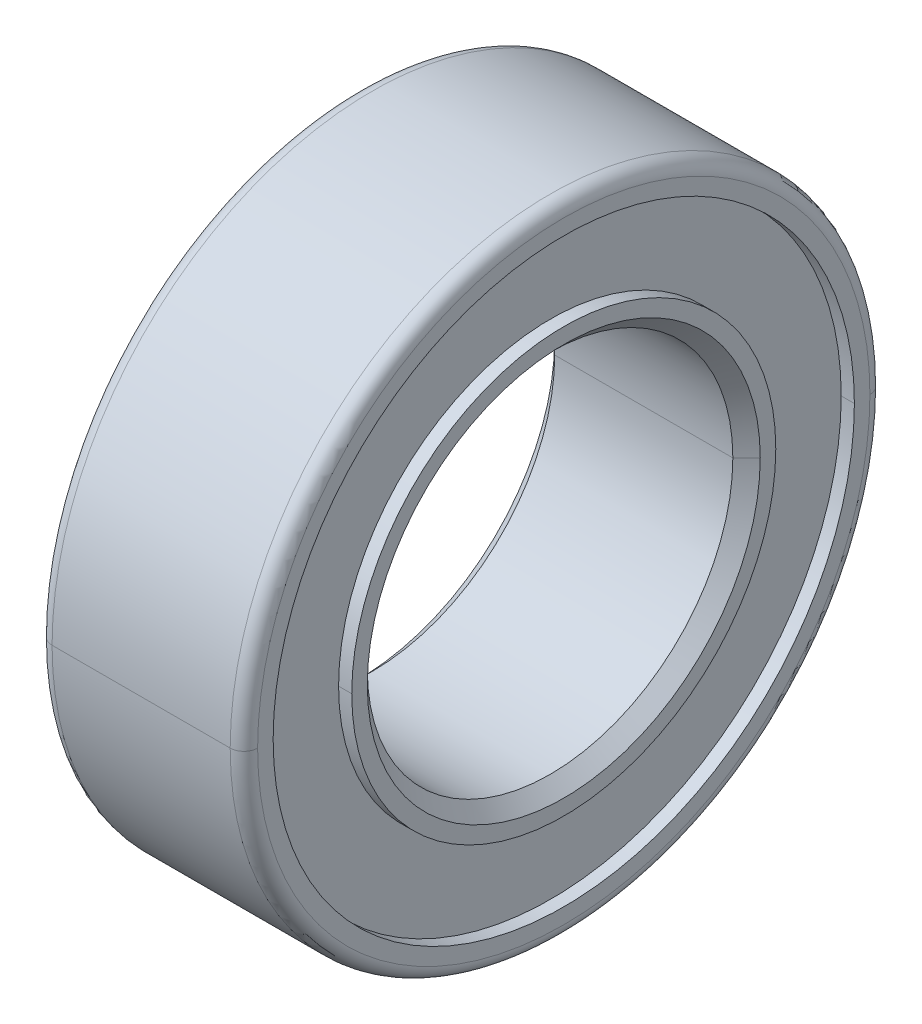
ISO-10303-21;
HEADER;
FILE_DESCRIPTION(('STEP AP214'),'2;1');
FILE_NAME('part.step','',(''),(''),'','','');
FILE_SCHEMA(('AUTOMOTIVE_DESIGN { 1 0 10303 214 1 1 1 1 }'));
ENDSEC;
DATA;
#1=APPLICATION_CONTEXT('core data for automotive mechanical design processes');
#2=APPLICATION_PROTOCOL_DEFINITION('international standard','automotive_design',2000,#1);
#3=PRODUCT_CONTEXT('',#1,'mechanical');
#4=PRODUCT('Part','Part','',(#3));
#5=PRODUCT_RELATED_PRODUCT_CATEGORY('part','',(#4));
#6=PRODUCT_DEFINITION_FORMATION('','',#4);
#7=PRODUCT_DEFINITION_CONTEXT('part definition',#1,'design');
#8=PRODUCT_DEFINITION('design','',#6,#7);
#9=PRODUCT_DEFINITION_SHAPE('','',#8);
#10=(LENGTH_UNIT() NAMED_UNIT(*) SI_UNIT(.MILLI.,.METRE.));
#11=(NAMED_UNIT(*) PLANE_ANGLE_UNIT() SI_UNIT($,.RADIAN.));
#12=(NAMED_UNIT(*) SI_UNIT($,.STERADIAN.) SOLID_ANGLE_UNIT());
#13=UNCERTAINTY_MEASURE_WITH_UNIT(LENGTH_MEASURE(1.E-05),#10,'distance_accuracy_value','');
#14=(GEOMETRIC_REPRESENTATION_CONTEXT(3) GLOBAL_UNCERTAINTY_ASSIGNED_CONTEXT((#13)) GLOBAL_UNIT_ASSIGNED_CONTEXT((#10,
#11,#12)) REPRESENTATION_CONTEXT('',''));
#15=CARTESIAN_POINT('',(0.,0.,0.));
#16=DIRECTION('',(0.,0.,1.));
#17=DIRECTION('',(1.,0.,0.));
#18=AXIS2_PLACEMENT_3D('',#15,#16,#17);
#19=CARTESIAN_POINT('',(0.,0.,0.));
#20=DIRECTION('',(-1.,0.,0.));
#21=DIRECTION('',(0.,0.,1.));
#22=AXIS2_PLACEMENT_3D('',#19,#20,#21);
#23=CYLINDRICAL_SURFACE('',#22,7.366);
#24=DIRECTION('',(-1.,0.,0.));
#25=VECTOR('',#24,1.);
#26=CARTESIAN_POINT('',(0.,0.,-7.366));
#27=LINE('',#26,#25);
#28=CARTESIAN_POINT('',(-3.113024,0.,-7.366));
#29=VERTEX_POINT('',#28);
#30=CARTESIAN_POINT('',(-3.570224,0.,-7.366));
#31=VERTEX_POINT('',#30);
#32=EDGE_CURVE('E220',#29,#31,#27,.T.);
#33=ORIENTED_EDGE('',*,*,#32,.F.);
#34=CARTESIAN_POINT('',(-3.113024,0.,0.));
#35=DIRECTION('',(-1.,0.,0.));
#36=DIRECTION('',(0.,0.,1.));
#37=AXIS2_PLACEMENT_3D('',#34,#35,#36);
#38=CIRCLE('',#37,7.366);
#39=CARTESIAN_POINT('',(-3.113024,0.,7.366));
#40=VERTEX_POINT('',#39);
#41=EDGE_CURVE('E11',#29,#40,#38,.T.);
#42=ORIENTED_EDGE('',*,*,#41,.T.);
#43=DIRECTION('',(-1.,0.,0.));
#44=VECTOR('',#43,1.);
#45=CARTESIAN_POINT('',(0.,0.,7.366));
#46=LINE('',#45,#44);
#47=CARTESIAN_POINT('',(-3.570224,0.,7.366));
#48=VERTEX_POINT('',#47);
#49=EDGE_CURVE('E195',#40,#48,#46,.T.);
#50=ORIENTED_EDGE('',*,*,#49,.T.);
#51=CARTESIAN_POINT('',(-3.570224,0.,0.));
#52=DIRECTION('',(-1.,0.,0.));
#53=DIRECTION('',(0.,0.,1.));
#54=AXIS2_PLACEMENT_3D('',#51,#52,#53);
#55=CIRCLE('',#54,7.366);
#56=EDGE_CURVE('E252',#31,#48,#55,.T.);
#57=ORIENTED_EDGE('',*,*,#56,.F.);
#58=EDGE_LOOP('',(#33,#42,#50,#57));
#59=FACE_BOUND('',#58,.T.);
#60=ADVANCED_FACE('F17',(#59),#23,.T.);
#61=CARTESIAN_POINT('',(-3.113024,7.366,0.));
#62=DIRECTION('',(1.,0.,0.));
#63=DIRECTION('',(0.,1.,0.));
#64=AXIS2_PLACEMENT_3D('',#61,#62,#63);
#65=PLANE('',#64);
#66=CARTESIAN_POINT('',(-3.113024,0.,0.));
#67=DIRECTION('',(-1.,0.,0.));
#68=DIRECTION('',(0.,0.,1.));
#69=AXIS2_PLACEMENT_3D('',#66,#67,#68);
#70=CIRCLE('',#69,7.366);
#71=EDGE_CURVE('E298',#40,#29,#70,.T.);
#72=ORIENTED_EDGE('',*,*,#71,.F.);
#73=ORIENTED_EDGE('',*,*,#41,.F.);
#74=EDGE_LOOP('',(#72,#73));
#75=FACE_BOUND('',#74,.T.);
#76=CARTESIAN_POINT('',(-3.113024,0.,0.));
#77=DIRECTION('',(-1.,0.,0.));
#78=DIRECTION('',(0.,0.,1.));
#79=AXIS2_PLACEMENT_3D('',#76,#77,#78);
#80=CIRCLE('',#79,10.0965);
#81=CARTESIAN_POINT('',(-3.113024,0.,10.0965));
#82=VERTEX_POINT('',#81);
#83=CARTESIAN_POINT('',(-3.113024,0.,-10.0965));
#84=VERTEX_POINT('',#83);
#85=EDGE_CURVE('E28',#82,#84,#80,.T.);
#86=ORIENTED_EDGE('',*,*,#85,.T.);
#87=CARTESIAN_POINT('',(-3.113024,0.,0.));
#88=DIRECTION('',(-1.,0.,0.));
#89=DIRECTION('',(0.,0.,1.));
#90=AXIS2_PLACEMENT_3D('',#87,#88,#89);
#91=CIRCLE('',#90,10.0965);
#92=EDGE_CURVE('E187',#84,#82,#91,.T.);
#93=ORIENTED_EDGE('',*,*,#92,.T.);
#94=EDGE_LOOP('',(#86,#93));
#95=FACE_BOUND('',#94,.T.);
#96=ADVANCED_FACE('F193',(#75,#95),#65,.F.);
#97=CARTESIAN_POINT('',(0.,0.,0.));
#98=DIRECTION('',(-1.,0.,0.));
#99=DIRECTION('',(0.,0.,1.));
#100=AXIS2_PLACEMENT_3D('',#97,#98,#99);
#101=CYLINDRICAL_SURFACE('',#100,10.0965);
#102=DIRECTION('',(-1.,0.,0.));
#103=VECTOR('',#102,1.);
#104=CARTESIAN_POINT('',(0.,0.,-10.0965));
#105=LINE('',#104,#103);
#106=CARTESIAN_POINT('',(-3.570224,0.,-10.0965));
#107=VERTEX_POINT('',#106);
#108=EDGE_CURVE('E178',#84,#107,#105,.T.);
#109=ORIENTED_EDGE('',*,*,#108,.F.);
#110=ORIENTED_EDGE('',*,*,#85,.F.);
#111=DIRECTION('',(-1.,0.,0.));
#112=VECTOR('',#111,1.);
#113=CARTESIAN_POINT('',(0.,0.,10.0965));
#114=LINE('',#113,#112);
#115=CARTESIAN_POINT('',(-3.570224,0.,10.0965));
#116=VERTEX_POINT('',#115);
#117=EDGE_CURVE('E175',#82,#116,#114,.T.);
#118=ORIENTED_EDGE('',*,*,#117,.T.);
#119=CARTESIAN_POINT('',(-3.570224,0.,0.));
#120=DIRECTION('',(-1.,0.,0.));
#121=DIRECTION('',(0.,0.,1.));
#122=AXIS2_PLACEMENT_3D('',#119,#120,#121);
#123=CIRCLE('',#122,10.0965);
#124=EDGE_CURVE('E183',#116,#107,#123,.T.);
#125=ORIENTED_EDGE('',*,*,#124,.T.);
#126=EDGE_LOOP('',(#109,#110,#118,#125));
#127=FACE_BOUND('',#126,.T.);
#128=ADVANCED_FACE('F174',(#127),#101,.F.);
#129=CARTESIAN_POINT('',(-3.570224,10.63625,0.));
#130=DIRECTION('',(1.,0.,0.));
#131=DIRECTION('',(0.,1.,0.));
#132=AXIS2_PLACEMENT_3D('',#129,#130,#131);
#133=PLANE('',#132);
#134=ORIENTED_EDGE('',*,*,#124,.F.);
#135=CARTESIAN_POINT('',(-3.570224,0.,0.));
#136=DIRECTION('',(-1.,0.,0.));
#137=DIRECTION('',(0.,0.,1.));
#138=AXIS2_PLACEMENT_3D('',#135,#136,#137);
#139=CIRCLE('',#138,10.0965);
#140=EDGE_CURVE('E189',#107,#116,#139,.T.);
#141=ORIENTED_EDGE('',*,*,#140,.F.);
#142=EDGE_LOOP('',(#134,#141));
#143=FACE_BOUND('',#142,.T.);
#144=CARTESIAN_POINT('',(-3.570224,0.,0.));
#145=DIRECTION('',(-1.,0.,0.));
#146=DIRECTION('',(0.,0.,1.));
#147=AXIS2_PLACEMENT_3D('',#144,#145,#146);
#148=CIRCLE('',#147,10.63625);
#149=CARTESIAN_POINT('',(-3.570224,0.,10.63625));
#150=VERTEX_POINT('',#149);
#151=CARTESIAN_POINT('',(-3.570224,0.,-10.63625));
#152=VERTEX_POINT('',#151);
#153=EDGE_CURVE('E207',#150,#152,#148,.T.);
#154=ORIENTED_EDGE('',*,*,#153,.T.);
#155=CARTESIAN_POINT('',(-3.570224,0.,0.));
#156=DIRECTION('',(-1.,0.,0.));
#157=DIRECTION('',(0.,0.,1.));
#158=AXIS2_PLACEMENT_3D('',#155,#156,#157);
#159=CIRCLE('',#158,10.63625);
#160=EDGE_CURVE('E303',#152,#150,#159,.T.);
#161=ORIENTED_EDGE('',*,*,#160,.T.);
#162=EDGE_LOOP('',(#154,#161));
#163=FACE_BOUND('',#162,.T.);
#164=ADVANCED_FACE('F395',(#143,#163),#133,.F.);
#165=CARTESIAN_POINT('',(-3.093974,0.,0.));
#166=DIRECTION('',(-1.,0.,0.));
#167=DIRECTION('',(0.,0.,1.));
#168=AXIS2_PLACEMENT_3D('',#165,#166,#167);
#169=TOROIDAL_SURFACE('',#168,10.63625,0.47625);
#170=CARTESIAN_POINT('',(-3.093974,0.,-10.63625));
#171=DIRECTION('',(0.,1.,0.));
#172=DIRECTION('',(0.,0.,1.));
#173=AXIS2_PLACEMENT_3D('',#170,#171,#172);
#174=CIRCLE('',#173,0.47625);
#175=CARTESIAN_POINT('',(-3.093974,0.,-11.1125));
#176=VERTEX_POINT('',#175);
#177=EDGE_CURVE('E210',#176,#152,#174,.T.);
#178=ORIENTED_EDGE('',*,*,#177,.F.);
#179=CARTESIAN_POINT('',(-3.093974,0.,0.));
#180=DIRECTION('',(-1.,0.,0.));
#181=DIRECTION('',(0.,0.,1.));
#182=AXIS2_PLACEMENT_3D('',#179,#180,#181);
#183=CIRCLE('',#182,11.1125);
#184=CARTESIAN_POINT('',(-3.093974,0.,11.1125));
#185=VERTEX_POINT('',#184);
#186=EDGE_CURVE('E265',#176,#185,#183,.T.);
#187=ORIENTED_EDGE('',*,*,#186,.T.);
#188=CARTESIAN_POINT('',(-3.093974,0.,10.63625));
#189=DIRECTION('',(0.,-1.,0.));
#190=DIRECTION('',(0.,0.,-1.));
#191=AXIS2_PLACEMENT_3D('',#188,#189,#190);
#192=CIRCLE('',#191,0.47625);
#193=EDGE_CURVE('E21',#185,#150,#192,.T.);
#194=ORIENTED_EDGE('',*,*,#193,.T.);
#195=ORIENTED_EDGE('',*,*,#160,.F.);
#196=EDGE_LOOP('',(#178,#187,#194,#195));
#197=FACE_BOUND('',#196,.T.);
#198=ADVANCED_FACE('F400',(#197),#169,.T.);
#199=CARTESIAN_POINT('',(0.,0.,0.));
#200=DIRECTION('',(-1.,0.,0.));
#201=DIRECTION('',(0.,0.,1.));
#202=AXIS2_PLACEMENT_3D('',#199,#200,#201);
#203=CYLINDRICAL_SURFACE('',#202,11.1125);
#204=DIRECTION('',(-1.,0.,0.));
#205=VECTOR('',#204,1.);
#206=CARTESIAN_POINT('',(0.,0.,-11.1125));
#207=LINE('',#206,#205);
#208=CARTESIAN_POINT('',(3.093974,0.,-11.1125));
#209=VERTEX_POINT('',#208);
#210=EDGE_CURVE('E292',#209,#176,#207,.T.);
#211=ORIENTED_EDGE('',*,*,#210,.F.);
#212=CARTESIAN_POINT('',(3.093974,0.,0.));
#213=DIRECTION('',(-1.,0.,0.));
#214=DIRECTION('',(0.,0.,1.));
#215=AXIS2_PLACEMENT_3D('',#212,#213,#214);
#216=CIRCLE('',#215,11.1125);
#217=CARTESIAN_POINT('',(3.093974,0.,11.1125));
#218=VERTEX_POINT('',#217);
#219=EDGE_CURVE('E262',#209,#218,#216,.T.);
#220=ORIENTED_EDGE('',*,*,#219,.T.);
#221=DIRECTION('',(-1.,0.,0.));
#222=VECTOR('',#221,1.);
#223=CARTESIAN_POINT('',(0.,0.,11.1125));
#224=LINE('',#223,#222);
#225=EDGE_CURVE('E228',#218,#185,#224,.T.);
#226=ORIENTED_EDGE('',*,*,#225,.T.);
#227=ORIENTED_EDGE('',*,*,#186,.F.);
#228=EDGE_LOOP('',(#211,#220,#226,#227));
#229=FACE_BOUND('',#228,.T.);
#230=ADVANCED_FACE('F555',(#229),#203,.T.);
#231=CARTESIAN_POINT('',(3.093974,0.,0.));
#232=DIRECTION('',(-1.,0.,0.));
#233=DIRECTION('',(0.,0.,1.));
#234=AXIS2_PLACEMENT_3D('',#231,#232,#233);
#235=TOROIDAL_SURFACE('',#234,10.63625,0.47625);
#236=CARTESIAN_POINT('',(3.093974,0.,-10.63625));
#237=DIRECTION('',(0.,1.,0.));
#238=DIRECTION('',(0.,0.,1.));
#239=AXIS2_PLACEMENT_3D('',#236,#237,#238);
#240=CIRCLE('',#239,0.47625);
#241=CARTESIAN_POINT('',(3.570224,0.,-10.63625));
#242=VERTEX_POINT('',#241);
#243=EDGE_CURVE('E216',#242,#209,#240,.T.);
#244=ORIENTED_EDGE('',*,*,#243,.F.);
#245=CARTESIAN_POINT('',(3.570224,0.,0.));
#246=DIRECTION('',(-1.,0.,0.));
#247=DIRECTION('',(0.,0.,1.));
#248=AXIS2_PLACEMENT_3D('',#245,#246,#247);
#249=CIRCLE('',#248,10.63625);
#250=CARTESIAN_POINT('',(3.570224,0.,10.63625));
#251=VERTEX_POINT('',#250);
#252=EDGE_CURVE('E266',#242,#251,#249,.T.);
#253=ORIENTED_EDGE('',*,*,#252,.T.);
#254=CARTESIAN_POINT('',(3.093974,0.,10.63625));
#255=DIRECTION('',(0.,-1.,0.));
#256=DIRECTION('',(0.,0.,-1.));
#257=AXIS2_PLACEMENT_3D('',#254,#255,#256);
#258=CIRCLE('',#257,0.47625);
#259=EDGE_CURVE('E211',#251,#218,#258,.T.);
#260=ORIENTED_EDGE('',*,*,#259,.T.);
#261=ORIENTED_EDGE('',*,*,#219,.F.);
#262=EDGE_LOOP('',(#244,#253,#260,#261));
#263=FACE_BOUND('',#262,.T.);
#264=ADVANCED_FACE('F546',(#263),#235,.T.);
#265=CARTESIAN_POINT('',(3.570224,10.63625,0.));
#266=DIRECTION('',(-1.,0.,0.));
#267=DIRECTION('',(0.,0.,1.));
#268=AXIS2_PLACEMENT_3D('',#265,#266,#267);
#269=PLANE('',#268);
#270=CARTESIAN_POINT('',(3.570224,0.,0.));
#271=DIRECTION('',(-1.,0.,0.));
#272=DIRECTION('',(0.,0.,1.));
#273=AXIS2_PLACEMENT_3D('',#270,#271,#272);
#274=CIRCLE('',#273,10.0965);
#275=CARTESIAN_POINT('',(3.570224,0.,10.0965));
#276=VERTEX_POINT('',#275);
#277=CARTESIAN_POINT('',(3.570224,0.,-10.0965));
#278=VERTEX_POINT('',#277);
#279=EDGE_CURVE('E98',#276,#278,#274,.T.);
#280=ORIENTED_EDGE('',*,*,#279,.T.);
#281=CARTESIAN_POINT('',(3.570224,0.,0.));
#282=DIRECTION('',(-1.,0.,0.));
#283=DIRECTION('',(0.,0.,1.));
#284=AXIS2_PLACEMENT_3D('',#281,#282,#283);
#285=CIRCLE('',#284,10.0965);
#286=EDGE_CURVE('E215',#278,#276,#285,.T.);
#287=ORIENTED_EDGE('',*,*,#286,.T.);
#288=EDGE_LOOP('',(#280,#287));
#289=FACE_BOUND('',#288,.T.);
#290=CARTESIAN_POINT('',(3.570224,0.,0.));
#291=DIRECTION('',(-1.,0.,0.));
#292=DIRECTION('',(0.,0.,1.));
#293=AXIS2_PLACEMENT_3D('',#290,#291,#292);
#294=CIRCLE('',#293,10.63625);
#295=EDGE_CURVE('E224',#251,#242,#294,.T.);
#296=ORIENTED_EDGE('',*,*,#295,.F.);
#297=ORIENTED_EDGE('',*,*,#252,.F.);
#298=EDGE_LOOP('',(#296,#297));
#299=FACE_BOUND('',#298,.T.);
#300=ADVANCED_FACE('F543',(#289,#299),#269,.F.);
#301=CARTESIAN_POINT('',(0.,0.,0.));
#302=DIRECTION('',(-1.,0.,0.));
#303=DIRECTION('',(0.,0.,1.));
#304=AXIS2_PLACEMENT_3D('',#301,#302,#303);
#305=CYLINDRICAL_SURFACE('',#304,10.0965);
#306=DIRECTION('',(-1.,0.,0.));
#307=VECTOR('',#306,1.);
#308=CARTESIAN_POINT('',(0.,0.,-10.0965));
#309=LINE('',#308,#307);
#310=CARTESIAN_POINT('',(3.113024,0.,-10.0965));
#311=VERTEX_POINT('',#310);
#312=EDGE_CURVE('E232',#278,#311,#309,.T.);
#313=ORIENTED_EDGE('',*,*,#312,.F.);
#314=ORIENTED_EDGE('',*,*,#279,.F.);
#315=DIRECTION('',(-1.,0.,0.));
#316=VECTOR('',#315,1.);
#317=CARTESIAN_POINT('',(0.,0.,10.0965));
#318=LINE('',#317,#316);
#319=CARTESIAN_POINT('',(3.113024,0.,10.0965));
#320=VERTEX_POINT('',#319);
#321=EDGE_CURVE('E276',#276,#320,#318,.T.);
#322=ORIENTED_EDGE('',*,*,#321,.T.);
#323=CARTESIAN_POINT('',(3.113024,0.,0.));
#324=DIRECTION('',(-1.,0.,0.));
#325=DIRECTION('',(0.,0.,1.));
#326=AXIS2_PLACEMENT_3D('',#323,#324,#325);
#327=CIRCLE('',#326,10.0965);
#328=EDGE_CURVE('E89',#320,#311,#327,.T.);
#329=ORIENTED_EDGE('',*,*,#328,.T.);
#330=EDGE_LOOP('',(#313,#314,#322,#329));
#331=FACE_BOUND('',#330,.T.);
#332=ADVANCED_FACE('F538',(#331),#305,.F.);
#333=CARTESIAN_POINT('',(3.113024,10.0965,0.));
#334=DIRECTION('',(-1.,0.,0.));
#335=DIRECTION('',(0.,0.,1.));
#336=AXIS2_PLACEMENT_3D('',#333,#334,#335);
#337=PLANE('',#336);
#338=CARTESIAN_POINT('',(3.113024,0.,0.));
#339=DIRECTION('',(-1.,0.,0.));
#340=DIRECTION('',(0.,0.,1.));
#341=AXIS2_PLACEMENT_3D('',#338,#339,#340);
#342=CIRCLE('',#341,7.366);
#343=CARTESIAN_POINT('',(3.113024,0.,7.366));
#344=VERTEX_POINT('',#343);
#345=CARTESIAN_POINT('',(3.113024,0.,-7.366));
#346=VERTEX_POINT('',#345);
#347=EDGE_CURVE('E270',#344,#346,#342,.T.);
#348=ORIENTED_EDGE('',*,*,#347,.T.);
#349=CARTESIAN_POINT('',(3.113024,0.,0.));
#350=DIRECTION('',(-1.,0.,0.));
#351=DIRECTION('',(0.,0.,1.));
#352=AXIS2_PLACEMENT_3D('',#349,#350,#351);
#353=CIRCLE('',#352,7.366);
#354=EDGE_CURVE('E286',#346,#344,#353,.T.);
#355=ORIENTED_EDGE('',*,*,#354,.T.);
#356=EDGE_LOOP('',(#348,#355));
#357=FACE_BOUND('',#356,.T.);
#358=ORIENTED_EDGE('',*,*,#328,.F.);
#359=CARTESIAN_POINT('',(3.113024,0.,0.));
#360=DIRECTION('',(-1.,0.,0.));
#361=DIRECTION('',(0.,0.,1.));
#362=AXIS2_PLACEMENT_3D('',#359,#360,#361);
#363=CIRCLE('',#362,10.0965);
#364=EDGE_CURVE('E236',#311,#320,#363,.T.);
#365=ORIENTED_EDGE('',*,*,#364,.F.);
#366=EDGE_LOOP('',(#358,#365));
#367=FACE_BOUND('',#366,.T.);
#368=ADVANCED_FACE('F535',(#357,#367),#337,.F.);
#369=CARTESIAN_POINT('',(0.,0.,0.));
#370=DIRECTION('',(-1.,0.,0.));
#371=DIRECTION('',(0.,0.,1.));
#372=AXIS2_PLACEMENT_3D('',#369,#370,#371);
#373=CYLINDRICAL_SURFACE('',#372,7.366);
#374=DIRECTION('',(-1.,0.,0.));
#375=VECTOR('',#374,1.);
#376=CARTESIAN_POINT('',(0.,0.,-7.366));
#377=LINE('',#376,#375);
#378=CARTESIAN_POINT('',(3.570224,0.,-7.366));
#379=VERTEX_POINT('',#378);
#380=EDGE_CURVE('E267',#379,#346,#377,.T.);
#381=ORIENTED_EDGE('',*,*,#380,.F.);
#382=CARTESIAN_POINT('',(3.570224,0.,0.));
#383=DIRECTION('',(-1.,0.,0.));
#384=DIRECTION('',(0.,0.,1.));
#385=AXIS2_PLACEMENT_3D('',#382,#383,#384);
#386=CIRCLE('',#385,7.366);
#387=CARTESIAN_POINT('',(3.570224,0.,7.366));
#388=VERTEX_POINT('',#387);
#389=EDGE_CURVE('E144',#379,#388,#386,.T.);
#390=ORIENTED_EDGE('',*,*,#389,.T.);
#391=DIRECTION('',(-1.,0.,0.));
#392=VECTOR('',#391,1.);
#393=CARTESIAN_POINT('',(0.,0.,7.366));
#394=LINE('',#393,#392);
#395=EDGE_CURVE('E280',#388,#344,#394,.T.);
#396=ORIENTED_EDGE('',*,*,#395,.T.);
#397=ORIENTED_EDGE('',*,*,#354,.F.);
#398=EDGE_LOOP('',(#381,#390,#396,#397));
#399=FACE_BOUND('',#398,.T.);
#400=ADVANCED_FACE('F526',(#399),#373,.T.);
#401=CARTESIAN_POINT('',(3.570224,7.366,0.));
#402=DIRECTION('',(-1.,0.,0.));
#403=DIRECTION('',(0.,0.,1.));
#404=AXIS2_PLACEMENT_3D('',#401,#402,#403);
#405=PLANE('',#404);
#406=CARTESIAN_POINT('',(3.570224,0.,0.));
#407=DIRECTION('',(-1.,0.,0.));
#408=DIRECTION('',(0.,0.,1.));
#409=AXIS2_PLACEMENT_3D('',#406,#407,#408);
#410=CIRCLE('',#409,6.82625);
#411=CARTESIAN_POINT('',(3.570224,0.,-6.82625));
#412=VERTEX_POINT('',#411);
#413=CARTESIAN_POINT('',(3.570224,0.,6.82625));
#414=VERTEX_POINT('',#413);
#415=EDGE_CURVE('E242',#412,#414,#410,.T.);
#416=ORIENTED_EDGE('',*,*,#415,.T.);
#417=CARTESIAN_POINT('',(3.570224,0.,0.));
#418=DIRECTION('',(-1.,0.,0.));
#419=DIRECTION('',(0.,0.,1.));
#420=AXIS2_PLACEMENT_3D('',#417,#418,#419);
#421=CIRCLE('',#420,6.82625);
#422=EDGE_CURVE('E247',#414,#412,#421,.T.);
#423=ORIENTED_EDGE('',*,*,#422,.T.);
#424=EDGE_LOOP('',(#416,#423));
#425=FACE_BOUND('',#424,.T.);
#426=CARTESIAN_POINT('',(3.570224,0.,0.));
#427=DIRECTION('',(-1.,0.,0.));
#428=DIRECTION('',(0.,0.,1.));
#429=AXIS2_PLACEMENT_3D('',#426,#427,#428);
#430=CIRCLE('',#429,7.366);
#431=EDGE_CURVE('E271',#388,#379,#430,.T.);
#432=ORIENTED_EDGE('',*,*,#431,.F.);
#433=ORIENTED_EDGE('',*,*,#389,.F.);
#434=EDGE_LOOP('',(#432,#433));
#435=FACE_BOUND('',#434,.T.);
#436=ADVANCED_FACE('F524',(#425,#435),#405,.F.);
#437=CARTESIAN_POINT('',(3.093974,0.,0.));
#438=DIRECTION('',(1.,0.,0.));
#439=DIRECTION('',(0.,0.,-1.));
#440=AXIS2_PLACEMENT_3D('',#437,#438,#439);
#441=CONICAL_SURFACE('',#440,6.35,0.785398163397448);
#442=DIRECTION('',(0.707106781186548,0.,0.707106781186548));
#443=VECTOR('',#442,1.);
#444=CARTESIAN_POINT('',(3.093974,0.,6.35));
#445=LINE('',#444,#443);
#446=CARTESIAN_POINT('',(3.093974,0.,6.35));
#447=VERTEX_POINT('',#446);
#448=EDGE_CURVE('E302',#447,#414,#445,.T.);
#449=ORIENTED_EDGE('',*,*,#448,.F.);
#450=CARTESIAN_POINT('',(3.093974,0.,0.));
#451=DIRECTION('',(-1.,0.,0.));
#452=DIRECTION('',(0.,0.,1.));
#453=AXIS2_PLACEMENT_3D('',#450,#451,#452);
#454=CIRCLE('',#453,6.35);
#455=CARTESIAN_POINT('',(3.093974,0.,-6.35));
#456=VERTEX_POINT('',#455);
#457=EDGE_CURVE('E250',#447,#456,#454,.T.);
#458=ORIENTED_EDGE('',*,*,#457,.T.);
#459=DIRECTION('',(0.707106781186548,0.,-0.707106781186548));
#460=VECTOR('',#459,1.);
#461=CARTESIAN_POINT('',(3.093974,0.,-6.35));
#462=LINE('',#461,#460);
#463=EDGE_CURVE('E237',#456,#412,#462,.T.);
#464=ORIENTED_EDGE('',*,*,#463,.T.);
#465=ORIENTED_EDGE('',*,*,#422,.F.);
#466=EDGE_LOOP('',(#449,#458,#464,#465));
#467=FACE_BOUND('',#466,.T.);
#468=ADVANCED_FACE('F369',(#467),#441,.F.);
#469=CARTESIAN_POINT('',(0.,0.,0.));
#470=DIRECTION('',(-1.,0.,0.));
#471=DIRECTION('',(0.,0.,1.));
#472=AXIS2_PLACEMENT_3D('',#469,#470,#471);
#473=CYLINDRICAL_SURFACE('',#472,6.35);
#474=DIRECTION('',(-1.,0.,0.));
#475=VECTOR('',#474,1.);
#476=CARTESIAN_POINT('',(0.,0.,-6.35));
#477=LINE('',#476,#475);
#478=CARTESIAN_POINT('',(-3.093974,0.,-6.35));
#479=VERTEX_POINT('',#478);
#480=EDGE_CURVE('E241',#456,#479,#477,.T.);
#481=ORIENTED_EDGE('',*,*,#480,.F.);
#482=ORIENTED_EDGE('',*,*,#457,.F.);
#483=DIRECTION('',(-1.,0.,0.));
#484=VECTOR('',#483,1.);
#485=CARTESIAN_POINT('',(0.,0.,6.35));
#486=LINE('',#485,#484);
#487=CARTESIAN_POINT('',(-3.093974,0.,6.35));
#488=VERTEX_POINT('',#487);
#489=EDGE_CURVE('E261',#447,#488,#486,.T.);
#490=ORIENTED_EDGE('',*,*,#489,.T.);
#491=CARTESIAN_POINT('',(-3.093974,0.,0.));
#492=DIRECTION('',(-1.,0.,0.));
#493=DIRECTION('',(0.,0.,1.));
#494=AXIS2_PLACEMENT_3D('',#491,#492,#493);
#495=CIRCLE('',#494,6.35);
#496=EDGE_CURVE('E318',#488,#479,#495,.T.);
#497=ORIENTED_EDGE('',*,*,#496,.T.);
#498=EDGE_LOOP('',(#481,#482,#490,#497));
#499=FACE_BOUND('',#498,.T.);
#500=ADVANCED_FACE('F375',(#499),#473,.F.);
#501=CARTESIAN_POINT('',(-3.570224,0.,0.));
#502=DIRECTION('',(-1.,0.,0.));
#503=DIRECTION('',(0.,0.,1.));
#504=AXIS2_PLACEMENT_3D('',#501,#502,#503);
#505=CONICAL_SURFACE('',#504,6.82625,0.785398163397448);
#506=DIRECTION('',(-0.707106781186548,0.,-0.707106781186548));
#507=VECTOR('',#506,1.);
#508=CARTESIAN_POINT('',(-3.570224,0.,-6.82625));
#509=LINE('',#508,#507);
#510=CARTESIAN_POINT('',(-3.570224,0.,-6.82625));
#511=VERTEX_POINT('',#510);
#512=EDGE_CURVE('E256',#479,#511,#509,.T.);
#513=ORIENTED_EDGE('',*,*,#512,.F.);
#514=ORIENTED_EDGE('',*,*,#496,.F.);
#515=DIRECTION('',(-0.707106781186548,0.,0.707106781186548));
#516=VECTOR('',#515,1.);
#517=CARTESIAN_POINT('',(-3.570224,0.,6.82625));
#518=LINE('',#517,#516);
#519=CARTESIAN_POINT('',(-3.570224,0.,6.82625));
#520=VERTEX_POINT('',#519);
#521=EDGE_CURVE('E254',#488,#520,#518,.T.);
#522=ORIENTED_EDGE('',*,*,#521,.T.);
#523=CARTESIAN_POINT('',(-3.570224,0.,0.));
#524=DIRECTION('',(-1.,0.,0.));
#525=DIRECTION('',(0.,0.,1.));
#526=AXIS2_PLACEMENT_3D('',#523,#524,#525);
#527=CIRCLE('',#526,6.82625);
#528=EDGE_CURVE('E42',#520,#511,#527,.T.);
#529=ORIENTED_EDGE('',*,*,#528,.T.);
#530=EDGE_LOOP('',(#513,#514,#522,#529));
#531=FACE_BOUND('',#530,.T.);
#532=ADVANCED_FACE('F578',(#531),#505,.F.);
#533=CARTESIAN_POINT('',(-3.570224,7.366,0.));
#534=DIRECTION('',(1.,0.,0.));
#535=DIRECTION('',(0.,1.,0.));
#536=AXIS2_PLACEMENT_3D('',#533,#534,#535);
#537=PLANE('',#536);
#538=ORIENTED_EDGE('',*,*,#528,.F.);
#539=CARTESIAN_POINT('',(-3.570224,0.,0.));
#540=DIRECTION('',(-1.,0.,0.));
#541=DIRECTION('',(0.,0.,1.));
#542=AXIS2_PLACEMENT_3D('',#539,#540,#541);
#543=CIRCLE('',#542,6.82625);
#544=EDGE_CURVE('E260',#511,#520,#543,.T.);
#545=ORIENTED_EDGE('',*,*,#544,.F.);
#546=EDGE_LOOP('',(#538,#545));
#547=FACE_BOUND('',#546,.T.);
#548=CARTESIAN_POINT('',(-3.570224,0.,0.));
#549=DIRECTION('',(-1.,0.,0.));
#550=DIRECTION('',(0.,0.,1.));
#551=AXIS2_PLACEMENT_3D('',#548,#549,#550);
#552=CIRCLE('',#551,7.366);
#553=EDGE_CURVE('E204',#48,#31,#552,.T.);
#554=ORIENTED_EDGE('',*,*,#553,.T.);
#555=ORIENTED_EDGE('',*,*,#56,.T.);
#556=EDGE_LOOP('',(#554,#555));
#557=FACE_BOUND('',#556,.T.);
#558=ADVANCED_FACE('F581',(#547,#557),#537,.F.);
#559=CARTESIAN_POINT('',(-3.570224,0.,0.));
#560=DIRECTION('',(-1.,0.,0.));
#561=DIRECTION('',(0.,0.,1.));
#562=AXIS2_PLACEMENT_3D('',#559,#560,#561);
#563=CONICAL_SURFACE('',#562,6.82625,0.785398163397448);
#564=CARTESIAN_POINT('',(-3.093974,0.,0.));
#565=DIRECTION('',(-1.,0.,0.));
#566=DIRECTION('',(0.,0.,1.));
#567=AXIS2_PLACEMENT_3D('',#564,#565,#566);
#568=CIRCLE('',#567,6.35);
#569=EDGE_CURVE('E246',#479,#488,#568,.T.);
#570=ORIENTED_EDGE('',*,*,#569,.F.);
#571=ORIENTED_EDGE('',*,*,#512,.T.);
#572=ORIENTED_EDGE('',*,*,#544,.T.);
#573=ORIENTED_EDGE('',*,*,#521,.F.);
#574=EDGE_LOOP('',(#570,#571,#572,#573));
#575=FACE_BOUND('',#574,.T.);
#576=ADVANCED_FACE('F587',(#575),#563,.F.);
#577=CARTESIAN_POINT('',(0.,0.,0.));
#578=DIRECTION('',(-1.,0.,0.));
#579=DIRECTION('',(0.,0.,1.));
#580=AXIS2_PLACEMENT_3D('',#577,#578,#579);
#581=CYLINDRICAL_SURFACE('',#580,6.35);
#582=CARTESIAN_POINT('',(3.093974,0.,0.));
#583=DIRECTION('',(-1.,0.,0.));
#584=DIRECTION('',(0.,0.,1.));
#585=AXIS2_PLACEMENT_3D('',#582,#583,#584);
#586=CIRCLE('',#585,6.35);
#587=EDGE_CURVE('E283',#456,#447,#586,.T.);
#588=ORIENTED_EDGE('',*,*,#587,.F.);
#589=ORIENTED_EDGE('',*,*,#480,.T.);
#590=ORIENTED_EDGE('',*,*,#569,.T.);
#591=ORIENTED_EDGE('',*,*,#489,.F.);
#592=EDGE_LOOP('',(#588,#589,#590,#591));
#593=FACE_BOUND('',#592,.T.);
#594=ADVANCED_FACE('F381',(#593),#581,.F.);
#595=CARTESIAN_POINT('',(3.093974,0.,0.));
#596=DIRECTION('',(1.,0.,0.));
#597=DIRECTION('',(0.,0.,-1.));
#598=AXIS2_PLACEMENT_3D('',#595,#596,#597);
#599=CONICAL_SURFACE('',#598,6.35,0.785398163397448);
#600=ORIENTED_EDGE('',*,*,#587,.T.);
#601=ORIENTED_EDGE('',*,*,#448,.T.);
#602=ORIENTED_EDGE('',*,*,#415,.F.);
#603=ORIENTED_EDGE('',*,*,#463,.F.);
#604=EDGE_LOOP('',(#600,#601,#602,#603));
#605=FACE_BOUND('',#604,.T.);
#606=ADVANCED_FACE('F380',(#605),#599,.F.);
#607=CARTESIAN_POINT('',(0.,0.,0.));
#608=DIRECTION('',(-1.,0.,0.));
#609=DIRECTION('',(0.,0.,1.));
#610=AXIS2_PLACEMENT_3D('',#607,#608,#609);
#611=CYLINDRICAL_SURFACE('',#610,7.366);
#612=ORIENTED_EDGE('',*,*,#431,.T.);
#613=ORIENTED_EDGE('',*,*,#380,.T.);
#614=ORIENTED_EDGE('',*,*,#347,.F.);
#615=ORIENTED_EDGE('',*,*,#395,.F.);
#616=EDGE_LOOP('',(#612,#613,#614,#615));
#617=FACE_BOUND('',#616,.T.);
#618=ADVANCED_FACE('F529',(#617),#611,.T.);
#619=CARTESIAN_POINT('',(0.,0.,0.));
#620=DIRECTION('',(-1.,0.,0.));
#621=DIRECTION('',(0.,0.,1.));
#622=AXIS2_PLACEMENT_3D('',#619,#620,#621);
#623=CYLINDRICAL_SURFACE('',#622,10.0965);
#624=ORIENTED_EDGE('',*,*,#286,.F.);
#625=ORIENTED_EDGE('',*,*,#312,.T.);
#626=ORIENTED_EDGE('',*,*,#364,.T.);
#627=ORIENTED_EDGE('',*,*,#321,.F.);
#628=EDGE_LOOP('',(#624,#625,#626,#627));
#629=FACE_BOUND('',#628,.T.);
#630=ADVANCED_FACE('F19',(#629),#623,.F.);
#631=CARTESIAN_POINT('',(3.093974,0.,0.));
#632=DIRECTION('',(-1.,0.,0.));
#633=DIRECTION('',(0.,0.,1.));
#634=AXIS2_PLACEMENT_3D('',#631,#632,#633);
#635=TOROIDAL_SURFACE('',#634,10.63625,0.47625);
#636=ORIENTED_EDGE('',*,*,#295,.T.);
#637=ORIENTED_EDGE('',*,*,#243,.T.);
#638=CARTESIAN_POINT('',(3.093974,0.,0.));
#639=DIRECTION('',(-1.,0.,0.));
#640=DIRECTION('',(0.,0.,1.));
#641=AXIS2_PLACEMENT_3D('',#638,#639,#640);
#642=CIRCLE('',#641,11.1125);
#643=EDGE_CURVE('E322',#218,#209,#642,.T.);
#644=ORIENTED_EDGE('',*,*,#643,.F.);
#645=ORIENTED_EDGE('',*,*,#259,.F.);
#646=EDGE_LOOP('',(#636,#637,#644,#645));
#647=FACE_BOUND('',#646,.T.);
#648=ADVANCED_FACE('F552',(#647),#635,.T.);
#649=CARTESIAN_POINT('',(0.,0.,0.));
#650=DIRECTION('',(-1.,0.,0.));
#651=DIRECTION('',(0.,0.,1.));
#652=AXIS2_PLACEMENT_3D('',#649,#650,#651);
#653=CYLINDRICAL_SURFACE('',#652,11.1125);
#654=ORIENTED_EDGE('',*,*,#643,.T.);
#655=ORIENTED_EDGE('',*,*,#210,.T.);
#656=CARTESIAN_POINT('',(-3.093974,0.,0.));
#657=DIRECTION('',(-1.,0.,0.));
#658=DIRECTION('',(0.,0.,1.));
#659=AXIS2_PLACEMENT_3D('',#656,#657,#658);
#660=CIRCLE('',#659,11.1125);
#661=EDGE_CURVE('E191',#185,#176,#660,.T.);
#662=ORIENTED_EDGE('',*,*,#661,.F.);
#663=ORIENTED_EDGE('',*,*,#225,.F.);
#664=EDGE_LOOP('',(#654,#655,#662,#663));
#665=FACE_BOUND('',#664,.T.);
#666=ADVANCED_FACE('F406',(#665),#653,.T.);
#667=CARTESIAN_POINT('',(-3.093974,0.,0.));
#668=DIRECTION('',(-1.,0.,0.));
#669=DIRECTION('',(0.,0.,1.));
#670=AXIS2_PLACEMENT_3D('',#667,#668,#669);
#671=TOROIDAL_SURFACE('',#670,10.63625,0.47625);
#672=ORIENTED_EDGE('',*,*,#661,.T.);
#673=ORIENTED_EDGE('',*,*,#177,.T.);
#674=ORIENTED_EDGE('',*,*,#153,.F.);
#675=ORIENTED_EDGE('',*,*,#193,.F.);
#676=EDGE_LOOP('',(#672,#673,#674,#675));
#677=FACE_BOUND('',#676,.T.);
#678=ADVANCED_FACE('F403',(#677),#671,.T.);
#679=CARTESIAN_POINT('',(0.,0.,0.));
#680=DIRECTION('',(-1.,0.,0.));
#681=DIRECTION('',(0.,0.,1.));
#682=AXIS2_PLACEMENT_3D('',#679,#680,#681);
#683=CYLINDRICAL_SURFACE('',#682,10.0965);
#684=ORIENTED_EDGE('',*,*,#92,.F.);
#685=ORIENTED_EDGE('',*,*,#108,.T.);
#686=ORIENTED_EDGE('',*,*,#140,.T.);
#687=ORIENTED_EDGE('',*,*,#117,.F.);
#688=EDGE_LOOP('',(#684,#685,#686,#687));
#689=FACE_BOUND('',#688,.T.);
#690=ADVANCED_FACE('F186',(#689),#683,.F.);
#691=CARTESIAN_POINT('',(0.,0.,0.));
#692=DIRECTION('',(-1.,0.,0.));
#693=DIRECTION('',(0.,0.,1.));
#694=AXIS2_PLACEMENT_3D('',#691,#692,#693);
#695=CYLINDRICAL_SURFACE('',#694,7.366);
#696=ORIENTED_EDGE('',*,*,#71,.T.);
#697=ORIENTED_EDGE('',*,*,#32,.T.);
#698=ORIENTED_EDGE('',*,*,#553,.F.);
#699=ORIENTED_EDGE('',*,*,#49,.F.);
#700=EDGE_LOOP('',(#696,#697,#698,#699));
#701=FACE_BOUND('',#700,.T.);
#702=ADVANCED_FACE('F598',(#701),#695,.T.);
#703=CLOSED_SHELL('',(#60,#96,#128,#164,#198,#230,#264,#300,#332,#368,#400,#436,#468,#500,#532,
#558,#576,#594,#606,#618,#630,#648,#666,#678,#690,#702));
#704=MANIFOLD_SOLID_BREP('B1',#703);
#705=ADVANCED_BREP_SHAPE_REPRESENTATION('',(#18,#704),#14);
#706=SHAPE_DEFINITION_REPRESENTATION(#9,#705);
ENDSEC;
END-ISO-10303-21;
